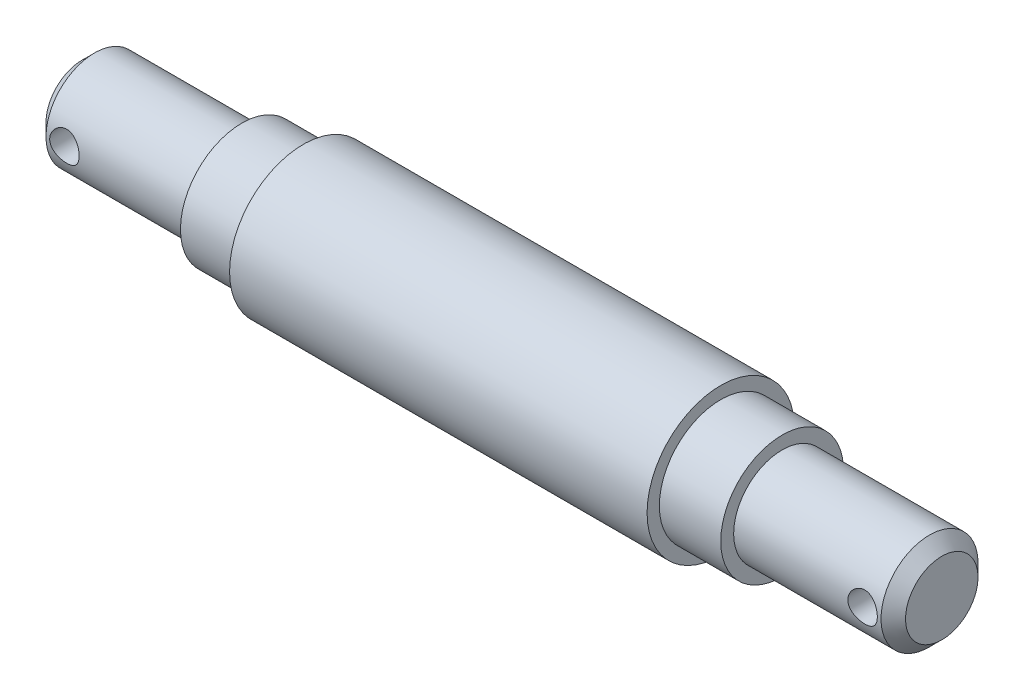
ISO-10303-21;
HEADER;
FILE_DESCRIPTION(('STEP AP214'),'2;1');
FILE_NAME('part.step','',(''),(''),'','','');
FILE_SCHEMA(('AUTOMOTIVE_DESIGN { 1 0 10303 214 1 1 1 1 }'));
ENDSEC;
DATA;
#1=APPLICATION_CONTEXT('core data for automotive mechanical design processes');
#2=APPLICATION_PROTOCOL_DEFINITION('international standard','automotive_design',2000,#1);
#3=PRODUCT_CONTEXT('',#1,'mechanical');
#4=PRODUCT('Part','Part','',(#3));
#5=PRODUCT_RELATED_PRODUCT_CATEGORY('part','',(#4));
#6=PRODUCT_DEFINITION_FORMATION('','',#4);
#7=PRODUCT_DEFINITION_CONTEXT('part definition',#1,'design');
#8=PRODUCT_DEFINITION('design','',#6,#7);
#9=PRODUCT_DEFINITION_SHAPE('','',#8);
#10=(LENGTH_UNIT() NAMED_UNIT(*) SI_UNIT(.MILLI.,.METRE.));
#11=(NAMED_UNIT(*) PLANE_ANGLE_UNIT() SI_UNIT($,.RADIAN.));
#12=(NAMED_UNIT(*) SI_UNIT($,.STERADIAN.) SOLID_ANGLE_UNIT());
#13=UNCERTAINTY_MEASURE_WITH_UNIT(LENGTH_MEASURE(1.E-05),#10,'distance_accuracy_value','');
#14=(GEOMETRIC_REPRESENTATION_CONTEXT(3) GLOBAL_UNCERTAINTY_ASSIGNED_CONTEXT((#13)) GLOBAL_UNIT_ASSIGNED_CONTEXT((#10,
#11,#12)) REPRESENTATION_CONTEXT('',''));
#15=CARTESIAN_POINT('',(0.,0.,0.));
#16=DIRECTION('',(0.,0.,1.));
#17=DIRECTION('',(1.,0.,0.));
#18=AXIS2_PLACEMENT_3D('',#15,#16,#17);
#19=CARTESIAN_POINT('',(0.,2.94999999999999,0.));
#20=DIRECTION('',(1.,0.,0.));
#21=DIRECTION('',(0.,0.,-1.));
#22=AXIS2_PLACEMENT_3D('',#19,#20,#21);
#23=PLANE('',#22);
#24=CARTESIAN_POINT('',(0.,0.,0.));
#25=DIRECTION('',(-1.,0.,0.));
#26=DIRECTION('',(0.,0.,1.));
#27=AXIS2_PLACEMENT_3D('',#24,#25,#26);
#28=CIRCLE('',#27,2.94999999999999);
#29=CARTESIAN_POINT('',(0.,0.,2.94999999999999));
#30=VERTEX_POINT('',#29);
#31=EDGE_CURVE('E117',#30,#30,#28,.T.);
#32=ORIENTED_EDGE('',*,*,#31,.T.);
#33=EDGE_LOOP('',(#32));
#34=FACE_BOUND('',#33,.T.);
#35=ADVANCED_FACE('F37',(#34),#23,.F.);
#36=CARTESIAN_POINT('',(70.,0.,0.));
#37=DIRECTION('',(-1.,0.,0.));
#38=DIRECTION('',(0.,0.,1.));
#39=AXIS2_PLACEMENT_3D('',#36,#37,#38);
#40=PLANE('',#39);
#41=CARTESIAN_POINT('',(70.,0.,0.));
#42=DIRECTION('',(-1.,0.,0.));
#43=DIRECTION('',(0.,0.,1.));
#44=AXIS2_PLACEMENT_3D('',#41,#42,#43);
#45=CIRCLE('',#44,2.95);
#46=CARTESIAN_POINT('',(70.,0.,2.95));
#47=VERTEX_POINT('',#46);
#48=EDGE_CURVE('E10',#47,#47,#45,.T.);
#49=ORIENTED_EDGE('',*,*,#48,.F.);
#50=EDGE_LOOP('',(#49));
#51=FACE_BOUND('',#50,.T.);
#52=ADVANCED_FACE('F105',(#51),#40,.F.);
#53=CARTESIAN_POINT('',(70.,0.,0.));
#54=DIRECTION('',(-1.,0.,0.));
#55=DIRECTION('',(0.,0.,1.));
#56=AXIS2_PLACEMENT_3D('',#53,#54,#55);
#57=CONICAL_SURFACE('',#56,2.95,0.785398163397448);
#58=CARTESIAN_POINT('',(69.,0.,0.));
#59=DIRECTION('',(-1.,0.,0.));
#60=DIRECTION('',(0.,0.,1.));
#61=AXIS2_PLACEMENT_3D('',#58,#59,#60);
#62=CIRCLE('',#61,3.95);
#63=CARTESIAN_POINT('',(69.,0.,3.95));
#64=VERTEX_POINT('',#63);
#65=EDGE_CURVE('E50',#64,#64,#62,.T.);
#66=ORIENTED_EDGE('',*,*,#65,.F.);
#67=EDGE_LOOP('',(#66));
#68=FACE_BOUND('',#67,.T.);
#69=ORIENTED_EDGE('',*,*,#48,.T.);
#70=EDGE_LOOP('',(#69));
#71=FACE_BOUND('',#70,.T.);
#72=ADVANCED_FACE('F100',(#68,#71),#57,.T.);
#73=CARTESIAN_POINT('',(0.,0.,0.));
#74=DIRECTION('',(-1.,0.,0.));
#75=DIRECTION('',(0.,0.,1.));
#76=AXIS2_PLACEMENT_3D('',#73,#74,#75);
#77=CYLINDRICAL_SURFACE('',#76,3.95);
#78=CARTESIAN_POINT('',(68.7,0.,3.95));
#79=CARTESIAN_POINT('',(68.699999309067,-0.0657921053393096,3.94999950148961));
#80=CARTESIAN_POINT('',(68.6945713423082,-0.131591214838203,3.94834057311497));
#81=CARTESIAN_POINT('',(68.6730560327882,-0.261270865350392,3.94188498697175));
#82=CARTESIAN_POINT('',(68.6569657419196,-0.325150870627958,3.93708746139313));
#83=CARTESIAN_POINT('',(68.6147143702164,-0.449103270402122,3.92487988296748));
#84=CARTESIAN_POINT('',(68.5885683676363,-0.509181209664437,3.91747374305666));
#85=CARTESIAN_POINT('',(68.5270102908556,-0.624100282433899,3.90081718663398));
#86=CARTESIAN_POINT('',(68.4915969145227,-0.678940678549645,3.89156651099519));
#87=CARTESIAN_POINT('',(68.4114139294501,-0.783438437222784,3.87190239177238));
#88=CARTESIAN_POINT('',(68.3664216080813,-0.832920325244443,3.86146466337096));
#89=CARTESIAN_POINT('',(68.2688324305187,-0.923765255505192,3.84074643294284));
#90=CARTESIAN_POINT('',(68.2162342575259,-0.965126888957126,3.83046595848297));
#91=CARTESIAN_POINT('',(68.1034313998918,-1.03948900030353,3.81096820781043));
#92=CARTESIAN_POINT('',(68.0430788331166,-1.07227379069014,3.80178104820254));
#93=CARTESIAN_POINT('',(67.9173927923664,-1.12715664878845,3.78587377700204));
#94=CARTESIAN_POINT('',(67.8520605536529,-1.14925735687915,3.77915305597243));
#95=CARTESIAN_POINT('',(67.7202430842059,-1.18150913793118,3.76919296296908));
#96=CARTESIAN_POINT('',(67.6538444632701,-1.19198431895655,3.76585939822971));
#97=CARTESIAN_POINT('',(67.5201549851538,-1.20169991107967,3.76277100880303));
#98=CARTESIAN_POINT('',(67.4528643545652,-1.20094312272632,3.76301529202458));
#99=CARTESIAN_POINT('',(67.3219501570623,-1.1884705081571,3.76697161773738));
#100=CARTESIAN_POINT('',(67.2582831860542,-1.17716250700933,3.7705546058486));
#101=CARTESIAN_POINT('',(67.1337964711495,-1.14456806673587,3.78057558453502));
#102=CARTESIAN_POINT('',(67.0729770153932,-1.12328062017983,3.7870138633498));
#103=CARTESIAN_POINT('',(66.9549220552885,-1.07103490290146,3.80212175360936));
#104=CARTESIAN_POINT('',(66.8977485195439,-1.03994563160966,3.81082129239325));
#105=CARTESIAN_POINT('',(66.7892941375805,-0.969069803090077,3.82945730084039));
#106=CARTESIAN_POINT('',(66.7380147553671,-0.929281092164124,3.8393940765405));
#107=CARTESIAN_POINT('',(66.6404934453549,-0.840117660833644,3.85990662941459));
#108=CARTESIAN_POINT('',(66.594561848265,-0.790405027053219,3.87049153542939));
#109=CARTESIAN_POINT('',(66.5116141422669,-0.683850928056176,3.8907306221033));
#110=CARTESIAN_POINT('',(66.474598623408,-0.627008991414062,3.90038474113935));
#111=CARTESIAN_POINT('',(66.4103388738867,-0.507235607809575,3.91776652995739));
#112=CARTESIAN_POINT('',(66.3831650382018,-0.444264225815952,3.92548020503653));
#113=CARTESIAN_POINT('',(66.3398862787667,-0.314356032727516,3.93801108754001));
#114=CARTESIAN_POINT('',(66.3237781858395,-0.247420362956473,3.94282912421219));
#115=CARTESIAN_POINT('',(66.3036084028364,-0.114120636053963,3.94889402423303));
#116=CARTESIAN_POINT('',(66.2991262681458,-0.0478257706931099,3.95026547137128));
#117=CARTESIAN_POINT('',(66.3011550878346,0.0845739664892645,3.94964905795108));
#118=CARTESIAN_POINT('',(66.3076645335288,0.150678863138067,3.94766165842204));
#119=CARTESIAN_POINT('',(66.3311524846441,0.279224843718509,3.94063250926792));
#120=CARTESIAN_POINT('',(66.3478839633591,0.341715383064576,3.93566287748284));
#121=CARTESIAN_POINT('',(66.3910425635287,0.46298751214422,3.9232462867588));
#122=CARTESIAN_POINT('',(66.4174708608141,0.521768651064515,3.91579902739437));
#123=CARTESIAN_POINT('',(66.4799699305355,0.635489778460965,3.89897895098375));
#124=CARTESIAN_POINT('',(66.5162528662978,0.690306912058737,3.88956496603778));
#125=CARTESIAN_POINT('',(66.5971744514623,0.793217107200196,3.86989097410411));
#126=CARTESIAN_POINT('',(66.6418152473686,0.841308435836415,3.85963075016098));
#127=CARTESIAN_POINT('',(66.7401615057773,0.93126219472894,3.8389403158374));
#128=CARTESIAN_POINT('',(66.7941430083754,0.972825315903959,3.82851804368209));
#129=CARTESIAN_POINT('',(66.9085410089933,1.04632580306949,3.8090881755083));
#130=CARTESIAN_POINT('',(66.9689573565118,1.07826339411975,3.80008054641565));
#131=CARTESIAN_POINT('',(67.0943366498449,1.13139313809661,3.78460257028509));
#132=CARTESIAN_POINT('',(67.1592778979753,1.15263302867236,3.77812098085674));
#133=CARTESIAN_POINT('',(67.2920499847157,1.18380847718295,3.76847037643667));
#134=CARTESIAN_POINT('',(67.3598797919581,1.1937480353996,3.76530018925136));
#135=CARTESIAN_POINT('',(67.4933883668788,1.20176405179564,3.76274882724403));
#136=CARTESIAN_POINT('',(67.559035178016,1.20032934218194,3.76321151382289));
#137=CARTESIAN_POINT('',(67.6891050998603,1.18680835860972,3.76749719259433));
#138=CARTESIAN_POINT('',(67.7535282618118,1.17472253171075,3.77132004375065));
#139=CARTESIAN_POINT('',(67.8785005993841,1.14056150948796,3.78178924861813));
#140=CARTESIAN_POINT('',(67.9390893895407,1.11861887679372,3.7883980639779));
#141=CARTESIAN_POINT('',(68.0557739216337,1.06547063438702,3.80368682812306));
#142=CARTESIAN_POINT('',(68.1118687842014,1.03426321734227,3.81236718094976));
#143=CARTESIAN_POINT('',(68.2202335502225,0.962110752635529,3.83122441855044));
#144=CARTESIAN_POINT('',(68.2722831917953,0.920846329538665,3.84144499898209));
#145=CARTESIAN_POINT('',(68.3688776312579,0.830322181374974,3.86202232713825));
#146=CARTESIAN_POINT('',(68.4134204581551,0.781060363153478,3.872379109857));
#147=CARTESIAN_POINT('',(68.4950812638234,0.674145848788934,3.89243751616363));
#148=CARTESIAN_POINT('',(68.5319339365529,0.61628443568486,3.90210985106116));
#149=CARTESIAN_POINT('',(68.5953376113773,0.494893212202996,3.91935319911683));
#150=CARTESIAN_POINT('',(68.6218932042363,0.431365943417147,3.92692514826385));
#151=CARTESIAN_POINT('',(68.6617030372843,0.307034616834357,3.93849330935894));
#152=CARTESIAN_POINT('',(68.6760247532901,0.246597141950737,3.94277212268363));
#153=CARTESIAN_POINT('',(68.6951727192245,0.124108329921254,3.94852545465588));
#154=CARTESIAN_POINT('',(68.7000006517108,0.062057280720298,3.95000047021142));
#155=CARTESIAN_POINT('',(68.7,0.,3.95));
#156=B_SPLINE_CURVE_WITH_KNOTS('',3,(#78,#79,#80,#81,#82,#83,#84,#85,#86,#87,#88,#89,#90,#91,
#92,#93,#94,#95,#96,#97,#98,#99,#100,#101,#102,#103,#104,#105,#106,#107,#108,#109,#110,#111,
#112,#113,#114,#115,#116,#117,#118,#119,#120,#121,#122,#123,#124,#125,#126,#127,#128,#129,#130,
#131,#132,#133,#134,#135,#136,#137,#138,#139,#140,#141,#142,#143,#144,#145,#146,#147,#148,#149,
#150,#151,#152,#153,#154,#155),.UNSPECIFIED.,.T.,.F.,(4,2,2,2,2,2,2,2,2,2,2,2,2,2,2,2,2,2,2,2,2,
2,2,2,2,2,2,2,2,2,2,2,2,2,2,2,2,2,4),(0.,0.197148320035393,0.394351173873383,0.591259473294277,
0.788195454606485,0.990340802366868,1.19252118949644,1.3993812680836,1.60619019875129,
1.80707614853398,2.00791201079834,2.20129315930618,2.39469383394965,2.59079745889569,
2.78694968780097,2.99151370492323,3.19609125598954,3.40210447220442,3.6080586625695,
3.80645362401528,4.00482135632748,4.19857515486445,4.39235245564506,4.59068721838334,
4.78907298841319,4.9948598043899,5.20064180838011,5.40549720473314,5.61028006032374,
5.80631124083041,6.00233419370825,6.1957963245016,6.3892962198399,6.59000270555275,
6.790761807026,6.99759277849253,7.20433143185223,7.39032118612839,7.57627797496915),.UNSPECIFIED.);
#157=CARTESIAN_POINT('',(68.7,0.,3.95));
#158=VERTEX_POINT('',#157);
#159=EDGE_CURVE('E40',#158,#158,#156,.T.);
#160=ORIENTED_EDGE('',*,*,#159,.T.);
#161=EDGE_LOOP('',(#160));
#162=FACE_BOUND('',#161,.T.);
#163=CARTESIAN_POINT('',(68.7,0.,-3.95));
#164=CARTESIAN_POINT('',(68.699999309067,0.0657921053393096,-3.94999950148961));
#165=CARTESIAN_POINT('',(68.6945713423082,0.131591214838203,-3.94834057311497));
#166=CARTESIAN_POINT('',(68.6730560327882,0.261270865350392,-3.94188498697175));
#167=CARTESIAN_POINT('',(68.6569657419196,0.325150870627958,-3.93708746139313));
#168=CARTESIAN_POINT('',(68.6147143702164,0.449103270402122,-3.92487988296748));
#169=CARTESIAN_POINT('',(68.5885683676363,0.509181209664437,-3.91747374305666));
#170=CARTESIAN_POINT('',(68.5270102908556,0.624100282433899,-3.90081718663398));
#171=CARTESIAN_POINT('',(68.4915969145227,0.678940678549645,-3.89156651099519));
#172=CARTESIAN_POINT('',(68.4114139294501,0.783438437222784,-3.87190239177238));
#173=CARTESIAN_POINT('',(68.3664216080813,0.832920325244443,-3.86146466337096));
#174=CARTESIAN_POINT('',(68.2688324305187,0.923765255505192,-3.84074643294284));
#175=CARTESIAN_POINT('',(68.2162342575259,0.965126888957126,-3.83046595848297));
#176=CARTESIAN_POINT('',(68.1034313998918,1.03948900030353,-3.81096820781043));
#177=CARTESIAN_POINT('',(68.0430788331166,1.07227379069014,-3.80178104820254));
#178=CARTESIAN_POINT('',(67.9173927923664,1.12715664878845,-3.78587377700204));
#179=CARTESIAN_POINT('',(67.8520605536529,1.14925735687915,-3.77915305597243));
#180=CARTESIAN_POINT('',(67.7202430842059,1.18150913793118,-3.76919296296908));
#181=CARTESIAN_POINT('',(67.6538444632701,1.19198431895655,-3.76585939822971));
#182=CARTESIAN_POINT('',(67.5201549851538,1.20169991107967,-3.76277100880303));
#183=CARTESIAN_POINT('',(67.4528643545652,1.20094312272632,-3.76301529202458));
#184=CARTESIAN_POINT('',(67.3219501570623,1.1884705081571,-3.76697161773738));
#185=CARTESIAN_POINT('',(67.2582831860542,1.17716250700933,-3.7705546058486));
#186=CARTESIAN_POINT('',(67.1337964711495,1.14456806673587,-3.78057558453502));
#187=CARTESIAN_POINT('',(67.0729770153932,1.12328062017983,-3.7870138633498));
#188=CARTESIAN_POINT('',(66.9549220552885,1.07103490290146,-3.80212175360936));
#189=CARTESIAN_POINT('',(66.8977485195439,1.03994563160966,-3.81082129239325));
#190=CARTESIAN_POINT('',(66.7892941375805,0.969069803090077,-3.82945730084039));
#191=CARTESIAN_POINT('',(66.7380147553671,0.929281092164124,-3.8393940765405));
#192=CARTESIAN_POINT('',(66.6404934453549,0.840117660833644,-3.85990662941459));
#193=CARTESIAN_POINT('',(66.594561848265,0.790405027053219,-3.87049153542939));
#194=CARTESIAN_POINT('',(66.5116141422669,0.683850928056176,-3.8907306221033));
#195=CARTESIAN_POINT('',(66.474598623408,0.627008991414062,-3.90038474113935));
#196=CARTESIAN_POINT('',(66.4103388738867,0.507235607809575,-3.91776652995739));
#197=CARTESIAN_POINT('',(66.3831650382018,0.444264225815952,-3.92548020503653));
#198=CARTESIAN_POINT('',(66.3398862787667,0.314356032727516,-3.93801108754001));
#199=CARTESIAN_POINT('',(66.3237781858395,0.247420362956473,-3.94282912421219));
#200=CARTESIAN_POINT('',(66.3036084028364,0.114120636053963,-3.94889402423303));
#201=CARTESIAN_POINT('',(66.2991262681458,0.0478257706931099,-3.95026547137128));
#202=CARTESIAN_POINT('',(66.3011550878346,-0.0845739664892645,-3.94964905795108));
#203=CARTESIAN_POINT('',(66.3076645335288,-0.150678863138067,-3.94766165842204));
#204=CARTESIAN_POINT('',(66.3311524846441,-0.279224843718509,-3.94063250926792));
#205=CARTESIAN_POINT('',(66.3478839633591,-0.341715383064576,-3.93566287748284));
#206=CARTESIAN_POINT('',(66.3910425635287,-0.46298751214422,-3.9232462867588));
#207=CARTESIAN_POINT('',(66.4174708608141,-0.521768651064515,-3.91579902739437));
#208=CARTESIAN_POINT('',(66.4799699305355,-0.635489778460965,-3.89897895098375));
#209=CARTESIAN_POINT('',(66.5162528662978,-0.690306912058737,-3.88956496603778));
#210=CARTESIAN_POINT('',(66.5971744514623,-0.793217107200196,-3.86989097410411));
#211=CARTESIAN_POINT('',(66.6418152473686,-0.841308435836415,-3.85963075016098));
#212=CARTESIAN_POINT('',(66.7401615057773,-0.93126219472894,-3.8389403158374));
#213=CARTESIAN_POINT('',(66.7941430083754,-0.972825315903959,-3.82851804368209));
#214=CARTESIAN_POINT('',(66.9085410089933,-1.04632580306949,-3.8090881755083));
#215=CARTESIAN_POINT('',(66.9689573565118,-1.07826339411975,-3.80008054641565));
#216=CARTESIAN_POINT('',(67.0943366498449,-1.13139313809661,-3.78460257028509));
#217=CARTESIAN_POINT('',(67.1592778979753,-1.15263302867236,-3.77812098085674));
#218=CARTESIAN_POINT('',(67.2920499847157,-1.18380847718295,-3.76847037643667));
#219=CARTESIAN_POINT('',(67.3598797919581,-1.1937480353996,-3.76530018925136));
#220=CARTESIAN_POINT('',(67.4933883668788,-1.20176405179564,-3.76274882724403));
#221=CARTESIAN_POINT('',(67.559035178016,-1.20032934218194,-3.76321151382289));
#222=CARTESIAN_POINT('',(67.6891050998603,-1.18680835860972,-3.76749719259433));
#223=CARTESIAN_POINT('',(67.7535282618118,-1.17472253171075,-3.77132004375065));
#224=CARTESIAN_POINT('',(67.8785005993841,-1.14056150948796,-3.78178924861813));
#225=CARTESIAN_POINT('',(67.9390893895407,-1.11861887679372,-3.7883980639779));
#226=CARTESIAN_POINT('',(68.0557739216337,-1.06547063438702,-3.80368682812306));
#227=CARTESIAN_POINT('',(68.1118687842014,-1.03426321734227,-3.81236718094976));
#228=CARTESIAN_POINT('',(68.2202335502225,-0.962110752635529,-3.83122441855044));
#229=CARTESIAN_POINT('',(68.2722831917953,-0.920846329538665,-3.84144499898209));
#230=CARTESIAN_POINT('',(68.3688776312579,-0.830322181374974,-3.86202232713825));
#231=CARTESIAN_POINT('',(68.4134204581551,-0.781060363153478,-3.872379109857));
#232=CARTESIAN_POINT('',(68.4950812638234,-0.674145848788934,-3.89243751616363));
#233=CARTESIAN_POINT('',(68.5319339365529,-0.61628443568486,-3.90210985106116));
#234=CARTESIAN_POINT('',(68.5953376113773,-0.494893212202996,-3.91935319911683));
#235=CARTESIAN_POINT('',(68.6218932042363,-0.431365943417147,-3.92692514826385));
#236=CARTESIAN_POINT('',(68.6617030372843,-0.307034616834357,-3.93849330935894));
#237=CARTESIAN_POINT('',(68.6760247532901,-0.246597141950737,-3.94277212268363));
#238=CARTESIAN_POINT('',(68.6951727192245,-0.124108329921254,-3.94852545465588));
#239=CARTESIAN_POINT('',(68.7000006517108,-0.062057280720298,-3.95000047021142));
#240=CARTESIAN_POINT('',(68.7,0.,-3.95));
#241=B_SPLINE_CURVE_WITH_KNOTS('',3,(#163,#164,#165,#166,#167,#168,#169,#170,#171,#172,#173,
#174,#175,#176,#177,#178,#179,#180,#181,#182,#183,#184,#185,#186,#187,#188,#189,#190,#191,#192,
#193,#194,#195,#196,#197,#198,#199,#200,#201,#202,#203,#204,#205,#206,#207,#208,#209,#210,#211,
#212,#213,#214,#215,#216,#217,#218,#219,#220,#221,#222,#223,#224,#225,#226,#227,#228,#229,#230,
#231,#232,#233,#234,#235,#236,#237,#238,#239,#240),.UNSPECIFIED.,.T.,.F.,(4,2,2,2,2,2,2,2,2,2,2,
2,2,2,2,2,2,2,2,2,2,2,2,2,2,2,2,2,2,2,2,2,2,2,2,2,2,2,4),(0.,0.197148320035393,
0.394351173873383,0.591259473294277,0.788195454606485,0.990340802366868,1.19252118949644,
1.3993812680836,1.60619019875129,1.80707614853398,2.00791201079834,2.20129315930618,
2.39469383394965,2.59079745889569,2.78694968780097,2.99151370492323,3.19609125598954,
3.40210447220442,3.6080586625695,3.80645362401528,4.00482135632748,4.19857515486445,
4.39235245564506,4.59068721838334,4.78907298841319,4.9948598043899,5.20064180838011,
5.40549720473314,5.61028006032374,5.80631124083041,6.00233419370825,6.1957963245016,
6.3892962198399,6.59000270555275,6.790761807026,6.99759277849253,7.20433143185223,
7.39032118612839,7.57627797496915),.UNSPECIFIED.);
#242=CARTESIAN_POINT('',(68.7,0.,-3.95));
#243=VERTEX_POINT('',#242);
#244=EDGE_CURVE('E88',#243,#243,#241,.T.);
#245=ORIENTED_EDGE('',*,*,#244,.T.);
#246=EDGE_LOOP('',(#245));
#247=FACE_BOUND('',#246,.T.);
#248=CARTESIAN_POINT('',(57.,0.,0.));
#249=DIRECTION('',(-1.,0.,0.));
#250=DIRECTION('',(0.,0.,1.));
#251=AXIS2_PLACEMENT_3D('',#248,#249,#250);
#252=CIRCLE('',#251,3.95);
#253=CARTESIAN_POINT('',(57.,0.,3.95));
#254=VERTEX_POINT('',#253);
#255=EDGE_CURVE('E56',#254,#254,#252,.T.);
#256=ORIENTED_EDGE('',*,*,#255,.F.);
#257=EDGE_LOOP('',(#256));
#258=FACE_BOUND('',#257,.T.);
#259=ORIENTED_EDGE('',*,*,#65,.T.);
#260=EDGE_LOOP('',(#259));
#261=FACE_BOUND('',#260,.T.);
#262=ADVANCED_FACE('F94',(#162,#247,#258,#261),#77,.T.);
#263=CARTESIAN_POINT('',(57.,3.95,0.));
#264=DIRECTION('',(-1.,0.,0.));
#265=DIRECTION('',(0.,0.,1.));
#266=AXIS2_PLACEMENT_3D('',#263,#264,#265);
#267=PLANE('',#266);
#268=CARTESIAN_POINT('',(57.,0.,0.));
#269=DIRECTION('',(-1.,0.,0.));
#270=DIRECTION('',(0.,0.,1.));
#271=AXIS2_PLACEMENT_3D('',#268,#269,#270);
#272=CIRCLE('',#271,5.);
#273=CARTESIAN_POINT('',(57.,0.,5.));
#274=VERTEX_POINT('',#273);
#275=EDGE_CURVE('E152',#274,#274,#272,.T.);
#276=ORIENTED_EDGE('',*,*,#275,.F.);
#277=EDGE_LOOP('',(#276));
#278=FACE_BOUND('',#277,.T.);
#279=ORIENTED_EDGE('',*,*,#255,.T.);
#280=EDGE_LOOP('',(#279));
#281=FACE_BOUND('',#280,.T.);
#282=ADVANCED_FACE('F99',(#278,#281),#267,.F.);
#283=CARTESIAN_POINT('',(0.,0.,0.));
#284=DIRECTION('',(-1.,0.,0.));
#285=DIRECTION('',(0.,0.,1.));
#286=AXIS2_PLACEMENT_3D('',#283,#284,#285);
#287=CYLINDRICAL_SURFACE('',#286,5.);
#288=CARTESIAN_POINT('',(52.,0.,0.));
#289=DIRECTION('',(-1.,0.,0.));
#290=DIRECTION('',(0.,0.,1.));
#291=AXIS2_PLACEMENT_3D('',#288,#289,#290);
#292=CIRCLE('',#291,5.);
#293=CARTESIAN_POINT('',(52.,0.,5.));
#294=VERTEX_POINT('',#293);
#295=EDGE_CURVE('E148',#294,#294,#292,.T.);
#296=ORIENTED_EDGE('',*,*,#295,.F.);
#297=EDGE_LOOP('',(#296));
#298=FACE_BOUND('',#297,.T.);
#299=ORIENTED_EDGE('',*,*,#275,.T.);
#300=EDGE_LOOP('',(#299));
#301=FACE_BOUND('',#300,.T.);
#302=ADVANCED_FACE('F163',(#298,#301),#287,.T.);
#303=CARTESIAN_POINT('',(52.,5.,0.));
#304=DIRECTION('',(-1.,0.,0.));
#305=DIRECTION('',(0.,0.,1.));
#306=AXIS2_PLACEMENT_3D('',#303,#304,#305);
#307=PLANE('',#306);
#308=CARTESIAN_POINT('',(52.,0.,0.));
#309=DIRECTION('',(-1.,0.,0.));
#310=DIRECTION('',(0.,0.,1.));
#311=AXIS2_PLACEMENT_3D('',#308,#309,#310);
#312=CIRCLE('',#311,6.);
#313=CARTESIAN_POINT('',(52.,0.,6.));
#314=VERTEX_POINT('',#313);
#315=EDGE_CURVE('E144',#314,#314,#312,.T.);
#316=ORIENTED_EDGE('',*,*,#315,.F.);
#317=EDGE_LOOP('',(#316));
#318=FACE_BOUND('',#317,.T.);
#319=ORIENTED_EDGE('',*,*,#295,.T.);
#320=EDGE_LOOP('',(#319));
#321=FACE_BOUND('',#320,.T.);
#322=ADVANCED_FACE('F168',(#318,#321),#307,.F.);
#323=CARTESIAN_POINT('',(0.,0.,0.));
#324=DIRECTION('',(-1.,0.,0.));
#325=DIRECTION('',(0.,0.,1.));
#326=AXIS2_PLACEMENT_3D('',#323,#324,#325);
#327=CYLINDRICAL_SURFACE('',#326,5.99999999999999);
#328=CARTESIAN_POINT('',(18.,0.,0.));
#329=DIRECTION('',(-1.,0.,0.));
#330=DIRECTION('',(0.,0.,1.));
#331=AXIS2_PLACEMENT_3D('',#328,#329,#330);
#332=CIRCLE('',#331,5.99999999999999);
#333=CARTESIAN_POINT('',(18.,0.,5.99999999999999));
#334=VERTEX_POINT('',#333);
#335=EDGE_CURVE('E140',#334,#334,#332,.T.);
#336=ORIENTED_EDGE('',*,*,#335,.F.);
#337=EDGE_LOOP('',(#336));
#338=FACE_BOUND('',#337,.T.);
#339=ORIENTED_EDGE('',*,*,#315,.T.);
#340=EDGE_LOOP('',(#339));
#341=FACE_BOUND('',#340,.T.);
#342=ADVANCED_FACE('F175',(#338,#341),#327,.T.);
#343=CARTESIAN_POINT('',(18.,5.99999999999999,0.));
#344=DIRECTION('',(1.,0.,0.));
#345=DIRECTION('',(0.,0.,-1.));
#346=AXIS2_PLACEMENT_3D('',#343,#344,#345);
#347=PLANE('',#346);
#348=CARTESIAN_POINT('',(18.,0.,0.));
#349=DIRECTION('',(-1.,0.,0.));
#350=DIRECTION('',(0.,0.,1.));
#351=AXIS2_PLACEMENT_3D('',#348,#349,#350);
#352=CIRCLE('',#351,4.99999999999999);
#353=CARTESIAN_POINT('',(18.,0.,4.99999999999999));
#354=VERTEX_POINT('',#353);
#355=EDGE_CURVE('E136',#354,#354,#352,.T.);
#356=ORIENTED_EDGE('',*,*,#355,.F.);
#357=EDGE_LOOP('',(#356));
#358=FACE_BOUND('',#357,.T.);
#359=ORIENTED_EDGE('',*,*,#335,.T.);
#360=EDGE_LOOP('',(#359));
#361=FACE_BOUND('',#360,.T.);
#362=ADVANCED_FACE('F182',(#358,#361),#347,.F.);
#363=CARTESIAN_POINT('',(0.,0.,0.));
#364=DIRECTION('',(-1.,0.,0.));
#365=DIRECTION('',(0.,0.,1.));
#366=AXIS2_PLACEMENT_3D('',#363,#364,#365);
#367=CYLINDRICAL_SURFACE('',#366,4.99999999999999);
#368=CARTESIAN_POINT('',(13.,0.,0.));
#369=DIRECTION('',(-1.,0.,0.));
#370=DIRECTION('',(0.,0.,1.));
#371=AXIS2_PLACEMENT_3D('',#368,#369,#370);
#372=CIRCLE('',#371,4.99999999999999);
#373=CARTESIAN_POINT('',(13.,0.,4.99999999999999));
#374=VERTEX_POINT('',#373);
#375=EDGE_CURVE('E132',#374,#374,#372,.T.);
#376=ORIENTED_EDGE('',*,*,#375,.F.);
#377=EDGE_LOOP('',(#376));
#378=FACE_BOUND('',#377,.T.);
#379=ORIENTED_EDGE('',*,*,#355,.T.);
#380=EDGE_LOOP('',(#379));
#381=FACE_BOUND('',#380,.T.);
#382=ADVANCED_FACE('F186',(#378,#381),#367,.T.);
#383=CARTESIAN_POINT('',(13.,4.99999999999999,0.));
#384=DIRECTION('',(1.,0.,0.));
#385=DIRECTION('',(0.,0.,-1.));
#386=AXIS2_PLACEMENT_3D('',#383,#384,#385);
#387=PLANE('',#386);
#388=CARTESIAN_POINT('',(13.,0.,0.));
#389=DIRECTION('',(-1.,0.,0.));
#390=DIRECTION('',(0.,0.,1.));
#391=AXIS2_PLACEMENT_3D('',#388,#389,#390);
#392=CIRCLE('',#391,3.94999999999999);
#393=CARTESIAN_POINT('',(13.,0.,3.94999999999999));
#394=VERTEX_POINT('',#393);
#395=EDGE_CURVE('E125',#394,#394,#392,.T.);
#396=ORIENTED_EDGE('',*,*,#395,.F.);
#397=EDGE_LOOP('',(#396));
#398=FACE_BOUND('',#397,.T.);
#399=ORIENTED_EDGE('',*,*,#375,.T.);
#400=EDGE_LOOP('',(#399));
#401=FACE_BOUND('',#400,.T.);
#402=ADVANCED_FACE('F189',(#398,#401),#387,.F.);
#403=CARTESIAN_POINT('',(0.,0.,0.));
#404=DIRECTION('',(-1.,0.,0.));
#405=DIRECTION('',(0.,0.,1.));
#406=AXIS2_PLACEMENT_3D('',#403,#404,#405);
#407=CYLINDRICAL_SURFACE('',#406,3.94999999999999);
#408=CARTESIAN_POINT('',(3.7,0.,3.94999999999999));
#409=CARTESIAN_POINT('',(3.69999930906702,-0.0657921053393094,3.9499995014896));
#410=CARTESIAN_POINT('',(3.6945713423082,-0.131591214838203,3.94834057311496));
#411=CARTESIAN_POINT('',(3.67305603278821,-0.261270865350393,3.94188498697174));
#412=CARTESIAN_POINT('',(3.65696574191961,-0.325150870627959,3.93708746139313));
#413=CARTESIAN_POINT('',(3.61471437021637,-0.449103270402122,3.92487988296747));
#414=CARTESIAN_POINT('',(3.58856836763629,-0.509181209664437,3.91747374305665));
#415=CARTESIAN_POINT('',(3.52701029085556,-0.624100282433899,3.90081718663397));
#416=CARTESIAN_POINT('',(3.4915969145227,-0.678940678549646,3.89156651099519));
#417=CARTESIAN_POINT('',(3.41141392945013,-0.783438437222785,3.87190239177237));
#418=CARTESIAN_POINT('',(3.36642160808127,-0.832920325244444,3.86146466337096));
#419=CARTESIAN_POINT('',(3.26883243051874,-0.923765255505193,3.84074643294283));
#420=CARTESIAN_POINT('',(3.21623425752584,-0.965126888957126,3.83046595848296));
#421=CARTESIAN_POINT('',(3.10343139989179,-1.03948900030353,3.81096820781043));
#422=CARTESIAN_POINT('',(3.0430788331166,-1.07227379069014,3.80178104820254));
#423=CARTESIAN_POINT('',(2.91739279236636,-1.12715664878844,3.78587377700204));
#424=CARTESIAN_POINT('',(2.85206055365289,-1.14925735687915,3.77915305597242));
#425=CARTESIAN_POINT('',(2.72024308420593,-1.18150913793118,3.76919296296907));
#426=CARTESIAN_POINT('',(2.6538444632701,-1.19198431895655,3.7658593982297));
#427=CARTESIAN_POINT('',(2.5201549851538,-1.20169991107967,3.76277100880302));
#428=CARTESIAN_POINT('',(2.45286435456517,-1.20094312272632,3.76301529202457));
#429=CARTESIAN_POINT('',(2.32195015706233,-1.1884705081571,3.76697161773737));
#430=CARTESIAN_POINT('',(2.25828318605416,-1.17716250700933,3.77055460584859));
#431=CARTESIAN_POINT('',(2.13379647114954,-1.14456806673587,3.78057558453501));
#432=CARTESIAN_POINT('',(2.0729770153932,-1.12328062017983,3.78701386334979));
#433=CARTESIAN_POINT('',(1.95492205528855,-1.07103490290146,3.80212175360935));
#434=CARTESIAN_POINT('',(1.89774851954395,-1.03994563160967,3.81082129239324));
#435=CARTESIAN_POINT('',(1.78929413758052,-0.969069803090083,3.82945730084038));
#436=CARTESIAN_POINT('',(1.73801475536715,-0.929281092164126,3.83939407654049));
#437=CARTESIAN_POINT('',(1.64049344535495,-0.840117660833642,3.85990662941458));
#438=CARTESIAN_POINT('',(1.594561848265,-0.79040502705322,3.87049153542938));
#439=CARTESIAN_POINT('',(1.5116141422669,-0.683850928056176,3.89073062210329));
#440=CARTESIAN_POINT('',(1.474598623408,-0.62700899141406,3.90038474113934));
#441=CARTESIAN_POINT('',(1.4103388738867,-0.507235607809572,3.91776652995739));
#442=CARTESIAN_POINT('',(1.38316503820175,-0.44426422581595,3.92548020503652));
#443=CARTESIAN_POINT('',(1.33988627876673,-0.314356032727517,3.93801108754));
#444=CARTESIAN_POINT('',(1.32377818583953,-0.247420362956477,3.94282912421218));
#445=CARTESIAN_POINT('',(1.30360840283639,-0.114120636053968,3.94889402423302));
#446=CARTESIAN_POINT('',(1.29912626814583,-0.0478257706931131,3.95026547137127));
#447=CARTESIAN_POINT('',(1.30115508783461,0.0845739664892639,3.94964905795107));
#448=CARTESIAN_POINT('',(1.30766453352877,0.150678863138068,3.94766165842203));
#449=CARTESIAN_POINT('',(1.33115248464411,0.279224843718511,3.94063250926792));
#450=CARTESIAN_POINT('',(1.34788396335906,0.341715383064578,3.93566287748283));
#451=CARTESIAN_POINT('',(1.39104256352873,0.462987512144223,3.9232462867588));
#452=CARTESIAN_POINT('',(1.41747086081414,0.521768651064517,3.91579902739437));
#453=CARTESIAN_POINT('',(1.47996993053552,0.635489778460967,3.89897895098374));
#454=CARTESIAN_POINT('',(1.51625286629778,0.690306912058738,3.88956496603778));
#455=CARTESIAN_POINT('',(1.59717445146228,0.793217107200197,3.8698909741041));
#456=CARTESIAN_POINT('',(1.64181524736855,0.841308435836415,3.85963075016097));
#457=CARTESIAN_POINT('',(1.74016150577724,0.931262194728939,3.83894031583739));
#458=CARTESIAN_POINT('',(1.79414300837538,0.972825315903956,3.82851804368208));
#459=CARTESIAN_POINT('',(1.90854100899331,1.04632580306949,3.8090881755083));
#460=CARTESIAN_POINT('',(1.96895735651179,1.07826339411975,3.80008054641564));
#461=CARTESIAN_POINT('',(2.09433664984492,1.1313931380966,3.78460257028508));
#462=CARTESIAN_POINT('',(2.15927789797527,1.15263302867236,3.77812098085674));
#463=CARTESIAN_POINT('',(2.29204998471573,1.18380847718295,3.76847037643666));
#464=CARTESIAN_POINT('',(2.35987979195806,1.1937480353996,3.76530018925135));
#465=CARTESIAN_POINT('',(2.49338836687882,1.20176405179564,3.76274882724402));
#466=CARTESIAN_POINT('',(2.55903517801601,1.20032934218194,3.76321151382288));
#467=CARTESIAN_POINT('',(2.68910509986034,1.18680835860971,3.76749719259432));
#468=CARTESIAN_POINT('',(2.7535282618118,1.17472253171075,3.77132004375064));
#469=CARTESIAN_POINT('',(2.8785005993841,1.14056150948796,3.78178924861813));
#470=CARTESIAN_POINT('',(2.93908938954066,1.11861887679372,3.78839806397789));
#471=CARTESIAN_POINT('',(3.05577392163373,1.06547063438702,3.80368682812305));
#472=CARTESIAN_POINT('',(3.11186878420141,1.03426321734227,3.81236718094975));
#473=CARTESIAN_POINT('',(3.22023355022249,0.962110752635532,3.83122441855043));
#474=CARTESIAN_POINT('',(3.27228319179532,0.920846329538669,3.84144499898208));
#475=CARTESIAN_POINT('',(3.36887763125794,0.830322181374976,3.86202232713825));
#476=CARTESIAN_POINT('',(3.41342045815515,0.781060363153478,3.87237910985699));
#477=CARTESIAN_POINT('',(3.49508126382335,0.674145848788933,3.89243751616363));
#478=CARTESIAN_POINT('',(3.53193393655291,0.61628443568486,3.90210985106116));
#479=CARTESIAN_POINT('',(3.59533761137734,0.494893212202997,3.91935319911682));
#480=CARTESIAN_POINT('',(3.62189320423625,0.431365943417147,3.92692514826384));
#481=CARTESIAN_POINT('',(3.66170303728428,0.307034616834357,3.93849330935893));
#482=CARTESIAN_POINT('',(3.6760247532901,0.246597141950737,3.94277212268363));
#483=CARTESIAN_POINT('',(3.69517271922448,0.124108329921255,3.94852545465588));
#484=CARTESIAN_POINT('',(3.70000065171074,0.0620572807202984,3.95000047021141));
#485=CARTESIAN_POINT('',(3.7,0.,3.94999999999999));
#486=B_SPLINE_CURVE_WITH_KNOTS('',3,(#408,#409,#410,#411,#412,#413,#414,#415,#416,#417,#418,
#419,#420,#421,#422,#423,#424,#425,#426,#427,#428,#429,#430,#431,#432,#433,#434,#435,#436,#437,
#438,#439,#440,#441,#442,#443,#444,#445,#446,#447,#448,#449,#450,#451,#452,#453,#454,#455,#456,
#457,#458,#459,#460,#461,#462,#463,#464,#465,#466,#467,#468,#469,#470,#471,#472,#473,#474,#475,
#476,#477,#478,#479,#480,#481,#482,#483,#484,#485),.UNSPECIFIED.,.T.,.F.,(4,2,2,2,2,2,2,2,2,2,2,
2,2,2,2,2,2,2,2,2,2,2,2,2,2,2,2,2,2,2,2,2,2,2,2,2,2,2,4),(0.,0.197148320035392,
0.394351173873383,0.591259473294278,0.78819545460649,0.990340802366872,1.19252118949645,
1.39938126808359,1.60619019875128,1.80707614853398,2.00791201079835,2.20129315930618,
2.39469383394963,2.59079745889567,2.78694968780097,2.99151370492323,3.19609125598955,
3.40210447220442,3.6080586625695,3.80645362401528,4.00482135632748,4.19857515486445,
4.39235245564506,4.59068721838334,4.78907298841319,4.99485980438989,5.2006418083801,
5.40549720473314,5.61028006032374,5.80631124083042,6.00233419370823,6.19579632450157,
6.38929621983989,6.59000270555274,6.790761807026,6.99759277849253,7.20433143185223,
7.39032118612838,7.57627797496915),.UNSPECIFIED.);
#487=CARTESIAN_POINT('',(3.7,0.,3.94999999999999));
#488=VERTEX_POINT('',#487);
#489=EDGE_CURVE('E69',#488,#488,#486,.T.);
#490=ORIENTED_EDGE('',*,*,#489,.T.);
#491=EDGE_LOOP('',(#490));
#492=FACE_BOUND('',#491,.T.);
#493=CARTESIAN_POINT('',(3.7,0.,-3.94999999999999));
#494=CARTESIAN_POINT('',(3.69999930906702,0.0657921053393094,-3.9499995014896));
#495=CARTESIAN_POINT('',(3.6945713423082,0.131591214838203,-3.94834057311496));
#496=CARTESIAN_POINT('',(3.67305603278821,0.261270865350393,-3.94188498697174));
#497=CARTESIAN_POINT('',(3.65696574191961,0.325150870627959,-3.93708746139313));
#498=CARTESIAN_POINT('',(3.61471437021637,0.449103270402122,-3.92487988296747));
#499=CARTESIAN_POINT('',(3.58856836763629,0.509181209664437,-3.91747374305665));
#500=CARTESIAN_POINT('',(3.52701029085556,0.624100282433899,-3.90081718663397));
#501=CARTESIAN_POINT('',(3.4915969145227,0.678940678549646,-3.89156651099519));
#502=CARTESIAN_POINT('',(3.41141392945013,0.783438437222785,-3.87190239177237));
#503=CARTESIAN_POINT('',(3.36642160808127,0.832920325244444,-3.86146466337096));
#504=CARTESIAN_POINT('',(3.26883243051874,0.923765255505193,-3.84074643294283));
#505=CARTESIAN_POINT('',(3.21623425752584,0.965126888957126,-3.83046595848296));
#506=CARTESIAN_POINT('',(3.10343139989179,1.03948900030353,-3.81096820781043));
#507=CARTESIAN_POINT('',(3.0430788331166,1.07227379069014,-3.80178104820254));
#508=CARTESIAN_POINT('',(2.91739279236636,1.12715664878844,-3.78587377700204));
#509=CARTESIAN_POINT('',(2.85206055365289,1.14925735687915,-3.77915305597242));
#510=CARTESIAN_POINT('',(2.72024308420593,1.18150913793118,-3.76919296296907));
#511=CARTESIAN_POINT('',(2.6538444632701,1.19198431895655,-3.7658593982297));
#512=CARTESIAN_POINT('',(2.5201549851538,1.20169991107967,-3.76277100880302));
#513=CARTESIAN_POINT('',(2.45286435456517,1.20094312272632,-3.76301529202457));
#514=CARTESIAN_POINT('',(2.32195015706233,1.1884705081571,-3.76697161773737));
#515=CARTESIAN_POINT('',(2.25828318605416,1.17716250700933,-3.77055460584859));
#516=CARTESIAN_POINT('',(2.13379647114954,1.14456806673587,-3.78057558453501));
#517=CARTESIAN_POINT('',(2.0729770153932,1.12328062017983,-3.78701386334979));
#518=CARTESIAN_POINT('',(1.95492205528855,1.07103490290146,-3.80212175360935));
#519=CARTESIAN_POINT('',(1.89774851954395,1.03994563160967,-3.81082129239324));
#520=CARTESIAN_POINT('',(1.78929413758052,0.969069803090083,-3.82945730084038));
#521=CARTESIAN_POINT('',(1.73801475536715,0.929281092164126,-3.83939407654049));
#522=CARTESIAN_POINT('',(1.64049344535495,0.840117660833642,-3.85990662941458));
#523=CARTESIAN_POINT('',(1.594561848265,0.79040502705322,-3.87049153542938));
#524=CARTESIAN_POINT('',(1.5116141422669,0.683850928056176,-3.89073062210329));
#525=CARTESIAN_POINT('',(1.474598623408,0.62700899141406,-3.90038474113934));
#526=CARTESIAN_POINT('',(1.4103388738867,0.507235607809572,-3.91776652995739));
#527=CARTESIAN_POINT('',(1.38316503820175,0.44426422581595,-3.92548020503652));
#528=CARTESIAN_POINT('',(1.33988627876673,0.314356032727517,-3.93801108754));
#529=CARTESIAN_POINT('',(1.32377818583953,0.247420362956477,-3.94282912421218));
#530=CARTESIAN_POINT('',(1.30360840283639,0.114120636053968,-3.94889402423302));
#531=CARTESIAN_POINT('',(1.29912626814583,0.0478257706931131,-3.95026547137127));
#532=CARTESIAN_POINT('',(1.30115508783461,-0.0845739664892639,-3.94964905795107));
#533=CARTESIAN_POINT('',(1.30766453352877,-0.150678863138068,-3.94766165842203));
#534=CARTESIAN_POINT('',(1.33115248464411,-0.279224843718511,-3.94063250926792));
#535=CARTESIAN_POINT('',(1.34788396335906,-0.341715383064578,-3.93566287748283));
#536=CARTESIAN_POINT('',(1.39104256352873,-0.462987512144223,-3.9232462867588));
#537=CARTESIAN_POINT('',(1.41747086081414,-0.521768651064517,-3.91579902739437));
#538=CARTESIAN_POINT('',(1.47996993053552,-0.635489778460967,-3.89897895098374));
#539=CARTESIAN_POINT('',(1.51625286629778,-0.690306912058738,-3.88956496603778));
#540=CARTESIAN_POINT('',(1.59717445146228,-0.793217107200197,-3.8698909741041));
#541=CARTESIAN_POINT('',(1.64181524736855,-0.841308435836415,-3.85963075016097));
#542=CARTESIAN_POINT('',(1.74016150577724,-0.931262194728939,-3.83894031583739));
#543=CARTESIAN_POINT('',(1.79414300837538,-0.972825315903956,-3.82851804368208));
#544=CARTESIAN_POINT('',(1.90854100899331,-1.04632580306949,-3.8090881755083));
#545=CARTESIAN_POINT('',(1.96895735651179,-1.07826339411975,-3.80008054641564));
#546=CARTESIAN_POINT('',(2.09433664984492,-1.1313931380966,-3.78460257028508));
#547=CARTESIAN_POINT('',(2.15927789797527,-1.15263302867236,-3.77812098085674));
#548=CARTESIAN_POINT('',(2.29204998471573,-1.18380847718295,-3.76847037643666));
#549=CARTESIAN_POINT('',(2.35987979195806,-1.1937480353996,-3.76530018925135));
#550=CARTESIAN_POINT('',(2.49338836687882,-1.20176405179564,-3.76274882724402));
#551=CARTESIAN_POINT('',(2.55903517801601,-1.20032934218194,-3.76321151382288));
#552=CARTESIAN_POINT('',(2.68910509986034,-1.18680835860971,-3.76749719259432));
#553=CARTESIAN_POINT('',(2.7535282618118,-1.17472253171075,-3.77132004375064));
#554=CARTESIAN_POINT('',(2.8785005993841,-1.14056150948796,-3.78178924861813));
#555=CARTESIAN_POINT('',(2.93908938954066,-1.11861887679372,-3.78839806397789));
#556=CARTESIAN_POINT('',(3.05577392163373,-1.06547063438702,-3.80368682812305));
#557=CARTESIAN_POINT('',(3.11186878420141,-1.03426321734227,-3.81236718094975));
#558=CARTESIAN_POINT('',(3.22023355022249,-0.962110752635532,-3.83122441855043));
#559=CARTESIAN_POINT('',(3.27228319179532,-0.920846329538669,-3.84144499898208));
#560=CARTESIAN_POINT('',(3.36887763125794,-0.830322181374976,-3.86202232713825));
#561=CARTESIAN_POINT('',(3.41342045815515,-0.781060363153478,-3.87237910985699));
#562=CARTESIAN_POINT('',(3.49508126382335,-0.674145848788933,-3.89243751616363));
#563=CARTESIAN_POINT('',(3.53193393655291,-0.61628443568486,-3.90210985106116));
#564=CARTESIAN_POINT('',(3.59533761137734,-0.494893212202997,-3.91935319911682));
#565=CARTESIAN_POINT('',(3.62189320423625,-0.431365943417147,-3.92692514826384));
#566=CARTESIAN_POINT('',(3.66170303728428,-0.307034616834357,-3.93849330935893));
#567=CARTESIAN_POINT('',(3.6760247532901,-0.246597141950737,-3.94277212268363));
#568=CARTESIAN_POINT('',(3.69517271922448,-0.124108329921255,-3.94852545465588));
#569=CARTESIAN_POINT('',(3.70000065171074,-0.0620572807202984,-3.95000047021141));
#570=CARTESIAN_POINT('',(3.7,0.,-3.94999999999999));
#571=B_SPLINE_CURVE_WITH_KNOTS('',3,(#493,#494,#495,#496,#497,#498,#499,#500,#501,#502,#503,
#504,#505,#506,#507,#508,#509,#510,#511,#512,#513,#514,#515,#516,#517,#518,#519,#520,#521,#522,
#523,#524,#525,#526,#527,#528,#529,#530,#531,#532,#533,#534,#535,#536,#537,#538,#539,#540,#541,
#542,#543,#544,#545,#546,#547,#548,#549,#550,#551,#552,#553,#554,#555,#556,#557,#558,#559,#560,
#561,#562,#563,#564,#565,#566,#567,#568,#569,#570),.UNSPECIFIED.,.T.,.F.,(4,2,2,2,2,2,2,2,2,2,2,
2,2,2,2,2,2,2,2,2,2,2,2,2,2,2,2,2,2,2,2,2,2,2,2,2,2,2,4),(0.,0.197148320035392,
0.394351173873383,0.591259473294278,0.78819545460649,0.990340802366872,1.19252118949645,
1.39938126808359,1.60619019875128,1.80707614853398,2.00791201079835,2.20129315930618,
2.39469383394963,2.59079745889567,2.78694968780097,2.99151370492323,3.19609125598955,
3.40210447220442,3.6080586625695,3.80645362401528,4.00482135632748,4.19857515486445,
4.39235245564506,4.59068721838334,4.78907298841319,4.99485980438989,5.2006418083801,
5.40549720473314,5.61028006032374,5.80631124083042,6.00233419370823,6.19579632450157,
6.38929621983989,6.59000270555274,6.790761807026,6.99759277849253,7.20433143185223,
7.39032118612838,7.57627797496915),.UNSPECIFIED.);
#572=CARTESIAN_POINT('',(3.7,0.,-3.94999999999999));
#573=VERTEX_POINT('',#572);
#574=EDGE_CURVE('E60',#573,#573,#571,.T.);
#575=ORIENTED_EDGE('',*,*,#574,.T.);
#576=EDGE_LOOP('',(#575));
#577=FACE_BOUND('',#576,.T.);
#578=CARTESIAN_POINT('',(1.,0.,0.));
#579=DIRECTION('',(-1.,0.,0.));
#580=DIRECTION('',(0.,0.,1.));
#581=AXIS2_PLACEMENT_3D('',#578,#579,#580);
#582=CIRCLE('',#581,3.94999999999999);
#583=CARTESIAN_POINT('',(1.,0.,3.94999999999999));
#584=VERTEX_POINT('',#583);
#585=EDGE_CURVE('E120',#584,#584,#582,.T.);
#586=ORIENTED_EDGE('',*,*,#585,.F.);
#587=EDGE_LOOP('',(#586));
#588=FACE_BOUND('',#587,.T.);
#589=ORIENTED_EDGE('',*,*,#395,.T.);
#590=EDGE_LOOP('',(#589));
#591=FACE_BOUND('',#590,.T.);
#592=ADVANCED_FACE('F73',(#492,#577,#588,#591),#407,.T.);
#593=CARTESIAN_POINT('',(1.,0.,0.));
#594=DIRECTION('',(1.,0.,0.));
#595=DIRECTION('',(0.,0.,-1.));
#596=AXIS2_PLACEMENT_3D('',#593,#594,#595);
#597=CONICAL_SURFACE('',#596,3.94999999999999,0.785398163397448);
#598=ORIENTED_EDGE('',*,*,#31,.F.);
#599=EDGE_LOOP('',(#598));
#600=FACE_BOUND('',#599,.T.);
#601=ORIENTED_EDGE('',*,*,#585,.T.);
#602=EDGE_LOOP('',(#601));
#603=FACE_BOUND('',#602,.T.);
#604=ADVANCED_FACE('F81',(#600,#603),#597,.T.);
#605=CARTESIAN_POINT('',(2.5,0.,-6.));
#606=DIRECTION('',(0.,0.,1.));
#607=DIRECTION('',(1.,0.,0.));
#608=AXIS2_PLACEMENT_3D('',#605,#606,#607);
#609=CYLINDRICAL_SURFACE('',#608,1.2);
#610=ORIENTED_EDGE('',*,*,#574,.F.);
#611=EDGE_LOOP('',(#610));
#612=FACE_BOUND('',#611,.T.);
#613=ORIENTED_EDGE('',*,*,#489,.F.);
#614=EDGE_LOOP('',(#613));
#615=FACE_BOUND('',#614,.T.);
#616=ADVANCED_FACE('F77',(#612,#615),#609,.F.);
#617=CARTESIAN_POINT('',(67.5,0.,-6.));
#618=DIRECTION('',(0.,0.,1.));
#619=DIRECTION('',(1.,0.,0.));
#620=AXIS2_PLACEMENT_3D('',#617,#618,#619);
#621=CYLINDRICAL_SURFACE('',#620,1.2);
#622=ORIENTED_EDGE('',*,*,#244,.F.);
#623=EDGE_LOOP('',(#622));
#624=FACE_BOUND('',#623,.T.);
#625=ORIENTED_EDGE('',*,*,#159,.F.);
#626=EDGE_LOOP('',(#625));
#627=FACE_BOUND('',#626,.T.);
#628=ADVANCED_FACE('F80',(#624,#627),#621,.F.);
#629=CLOSED_SHELL('',(#35,#52,#72,#262,#282,#302,#322,#342,#362,#382,#402,#592,#604,#616,#628));
#630=MANIFOLD_SOLID_BREP('B2',#629);
#631=ADVANCED_BREP_SHAPE_REPRESENTATION('',(#18,#630),#14);
#632=SHAPE_DEFINITION_REPRESENTATION(#9,#631);
ENDSEC;
END-ISO-10303-21;
